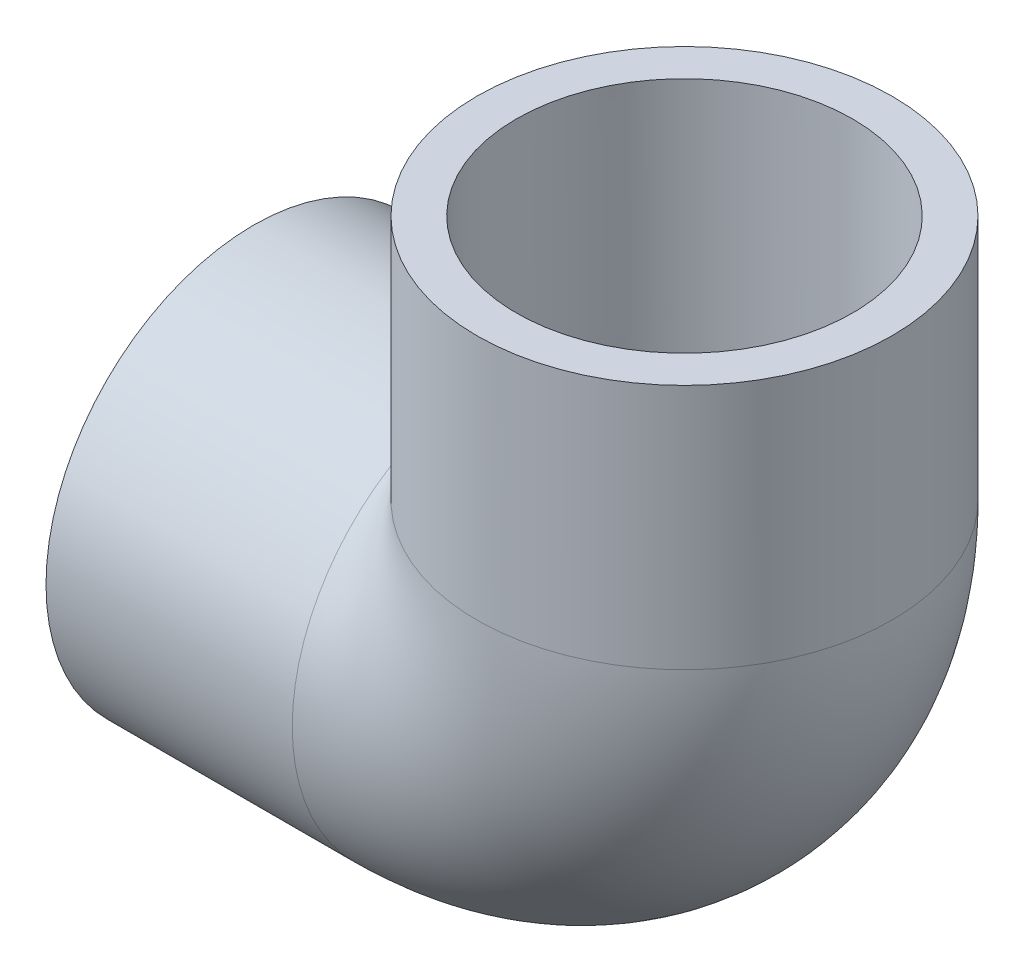
ISO-10303-21;
HEADER;
FILE_DESCRIPTION(('STEP AP214'),'2;1');
FILE_NAME('part.step','',(''),(''),'','','');
FILE_SCHEMA(('AUTOMOTIVE_DESIGN { 1 0 10303 214 1 1 1 1 }'));
ENDSEC;
DATA;
#1=APPLICATION_CONTEXT('core data for automotive mechanical design processes');
#2=APPLICATION_PROTOCOL_DEFINITION('international standard','automotive_design',2000,#1);
#3=PRODUCT_CONTEXT('',#1,'mechanical');
#4=PRODUCT('Part','Part','',(#3));
#5=PRODUCT_RELATED_PRODUCT_CATEGORY('part','',(#4));
#6=PRODUCT_DEFINITION_FORMATION('','',#4);
#7=PRODUCT_DEFINITION_CONTEXT('part definition',#1,'design');
#8=PRODUCT_DEFINITION('design','',#6,#7);
#9=PRODUCT_DEFINITION_SHAPE('','',#8);
#10=(LENGTH_UNIT() NAMED_UNIT(*) SI_UNIT(.MILLI.,.METRE.));
#11=(NAMED_UNIT(*) PLANE_ANGLE_UNIT() SI_UNIT($,.RADIAN.));
#12=(NAMED_UNIT(*) SI_UNIT($,.STERADIAN.) SOLID_ANGLE_UNIT());
#13=UNCERTAINTY_MEASURE_WITH_UNIT(LENGTH_MEASURE(1.E-05),#10,'distance_accuracy_value','');
#14=(GEOMETRIC_REPRESENTATION_CONTEXT(3) GLOBAL_UNCERTAINTY_ASSIGNED_CONTEXT((#13)) GLOBAL_UNIT_ASSIGNED_CONTEXT((#10,
#11,#12)) REPRESENTATION_CONTEXT('',''));
#15=CARTESIAN_POINT('',(0.,0.,0.));
#16=DIRECTION('',(0.,0.,1.));
#17=DIRECTION('',(1.,0.,0.));
#18=AXIS2_PLACEMENT_3D('',#15,#16,#17);
#19=CARTESIAN_POINT('',(-62.23,-29.972,0.));
#20=DIRECTION('',(-1.,0.,0.));
#21=DIRECTION('',(0.,0.,1.));
#22=AXIS2_PLACEMENT_3D('',#19,#20,#21);
#23=PLANE('',#22);
#24=CARTESIAN_POINT('',(-62.23,0.,0.));
#25=DIRECTION('',(-1.,0.,0.));
#26=DIRECTION('',(0.,0.,1.));
#27=AXIS2_PLACEMENT_3D('',#24,#25,#26);
#28=CIRCLE('',#27,29.972);
#29=CARTESIAN_POINT('',(-62.23,0.,29.972));
#30=VERTEX_POINT('',#29);
#31=EDGE_CURVE('E57',#30,#30,#28,.T.);
#32=ORIENTED_EDGE('',*,*,#31,.T.);
#33=EDGE_LOOP('',(#32));
#34=FACE_BOUND('',#33,.T.);
#35=CARTESIAN_POINT('',(-62.23,0.,0.));
#36=DIRECTION('',(-1.,0.,0.));
#37=DIRECTION('',(0.,0.,1.));
#38=AXIS2_PLACEMENT_3D('',#35,#36,#37);
#39=CIRCLE('',#38,24.2824);
#40=CARTESIAN_POINT('',(-62.23,0.,24.2824));
#41=VERTEX_POINT('',#40);
#42=EDGE_CURVE('E44',#41,#41,#39,.T.);
#43=ORIENTED_EDGE('',*,*,#42,.F.);
#44=EDGE_LOOP('',(#43));
#45=FACE_BOUND('',#44,.T.);
#46=ADVANCED_FACE('F37',(#34,#45),#23,.T.);
#47=CARTESIAN_POINT('',(-26.67,0.,0.));
#48=DIRECTION('',(-1.,0.,0.));
#49=DIRECTION('',(0.,0.,1.));
#50=AXIS2_PLACEMENT_3D('',#47,#48,#49);
#51=CONICAL_SURFACE('',#50,24.0538,0.00642848287391597);
#52=ORIENTED_EDGE('',*,*,#42,.T.);
#53=EDGE_LOOP('',(#52));
#54=FACE_BOUND('',#53,.T.);
#55=CARTESIAN_POINT('',(-26.67,0.,0.));
#56=DIRECTION('',(-1.,0.,0.));
#57=DIRECTION('',(0.,0.,1.));
#58=AXIS2_PLACEMENT_3D('',#55,#56,#57);
#59=CIRCLE('',#58,24.0538);
#60=CARTESIAN_POINT('',(-26.67,0.,24.0538));
#61=VERTEX_POINT('',#60);
#62=EDGE_CURVE('E68',#61,#61,#59,.T.);
#63=ORIENTED_EDGE('',*,*,#62,.F.);
#64=EDGE_LOOP('',(#63));
#65=FACE_BOUND('',#64,.T.);
#66=ADVANCED_FACE('F77',(#54,#65),#51,.F.);
#67=CARTESIAN_POINT('',(-62.23,0.,0.));
#68=DIRECTION('',(-1.,0.,0.));
#69=DIRECTION('',(0.,0.,1.));
#70=AXIS2_PLACEMENT_3D('',#67,#68,#69);
#71=CYLINDRICAL_SURFACE('',#70,29.972);
#72=CARTESIAN_POINT('',(0.,0.,0.));
#73=DIRECTION('',(-0.707106781186547,-0.707106781186547,0.));
#74=DIRECTION('',(-0.707106781186547,0.707106781186547,0.));
#75=AXIS2_PLACEMENT_3D('',#72,#73,#74);
#76=ELLIPSE('',#75,42.3868088914464,29.972);
#77=CARTESIAN_POINT('',(-26.67,26.67,-13.6759600759873));
#78=VERTEX_POINT('',#77);
#79=CARTESIAN_POINT('',(-26.67,26.67,13.6759600759873));
#80=VERTEX_POINT('',#79);
#81=EDGE_CURVE('E56',#78,#80,#76,.F.);
#82=ORIENTED_EDGE('',*,*,#81,.F.);
#83=CARTESIAN_POINT('',(-26.67,0.,0.));
#84=DIRECTION('',(-1.,0.,0.));
#85=DIRECTION('',(0.,0.,1.));
#86=AXIS2_PLACEMENT_3D('',#83,#84,#85);
#87=CIRCLE('',#86,29.972);
#88=EDGE_CURVE('E63',#78,#80,#87,.T.);
#89=ORIENTED_EDGE('',*,*,#88,.T.);
#90=EDGE_LOOP('',(#82,#89));
#91=FACE_BOUND('',#90,.T.);
#92=ORIENTED_EDGE('',*,*,#31,.F.);
#93=EDGE_LOOP('',(#92));
#94=FACE_BOUND('',#93,.T.);
#95=ADVANCED_FACE('F61',(#91,#94),#71,.T.);
#96=CARTESIAN_POINT('',(-26.67,26.67,0.));
#97=DIRECTION('',(0.,0.,-1.));
#98=DIRECTION('',(-1.,0.,0.));
#99=AXIS2_PLACEMENT_3D('',#96,#97,#98);
#100=TOROIDAL_SURFACE('',#99,26.67,19.05);
#101=CARTESIAN_POINT('',(0.,26.67,0.));
#102=DIRECTION('',(0.,1.,0.));
#103=DIRECTION('',(0.,0.,-1.));
#104=AXIS2_PLACEMENT_3D('',#101,#102,#103);
#105=CIRCLE('',#104,19.05);
#106=CARTESIAN_POINT('',(19.05,26.67,0.));
#107=VERTEX_POINT('',#106);
#108=EDGE_CURVE('E58',#107,#107,#105,.T.);
#109=CARTESIAN_POINT('',(-26.67,0.,0.));
#110=DIRECTION('',(1.,0.,0.));
#111=DIRECTION('',(0.,0.,-1.));
#112=AXIS2_PLACEMENT_3D('',#109,#110,#111);
#113=CIRCLE('',#112,19.05);
#114=CARTESIAN_POINT('',(-26.67,-19.05,0.));
#115=VERTEX_POINT('',#114);
#116=EDGE_CURVE('E64',#115,#115,#113,.T.);
#117=CARTESIAN_POINT('',(-26.67,26.67,0.));
#118=DIRECTION('',(0.,0.,-1.));
#119=DIRECTION('',(-1.,0.,0.));
#120=AXIS2_PLACEMENT_3D('',#117,#118,#119);
#121=CIRCLE('',#120,45.72);
#122=EDGE_CURVE('',#107,#115,#121,.T.);
#123=ORIENTED_EDGE('',*,*,#108,.T.);
#124=ORIENTED_EDGE('',*,*,#116,.F.);
#125=ORIENTED_EDGE('',*,*,#122,.T.);
#126=ORIENTED_EDGE('',*,*,#122,.F.);
#127=EDGE_LOOP('',(#123,#125,#124,#126));
#128=FACE_BOUND('',#127,.T.);
#129=ADVANCED_FACE('F87',(#128),#100,.F.);
#130=CARTESIAN_POINT('',(-53.34,26.67,0.));
#131=DIRECTION('',(0.,-1.,0.));
#132=DIRECTION('',(-1.,0.,0.));
#133=AXIS2_PLACEMENT_3D('',#130,#131,#132);
#134=CIRCLE('',#133,29.972);
#135=TRIMMED_CURVE('',#134,(PARAMETER_VALUE(-2.66776990694721)),
(PARAMETER_VALUE(2.66776990694721)),.T.,.PARAMETER.);
#136=CARTESIAN_POINT('',(-26.67,26.67,0.));
#137=DIRECTION('',(0.,0.,-1.));
#138=AXIS1_PLACEMENT('',#136,#137);
#139=SURFACE_OF_REVOLUTION('',#135,#138);
#140=CARTESIAN_POINT('',(0.,26.67,0.));
#141=DIRECTION('',(0.,1.,0.));
#142=DIRECTION('',(0.,0.,-1.));
#143=AXIS2_PLACEMENT_3D('',#140,#141,#142);
#144=CIRCLE('',#143,29.972);
#145=EDGE_CURVE('E50',#80,#78,#144,.T.);
#146=ORIENTED_EDGE('',*,*,#145,.F.);
#147=ORIENTED_EDGE('',*,*,#88,.F.);
#148=EDGE_LOOP('',(#146,#147));
#149=FACE_BOUND('',#148,.T.);
#150=ADVANCED_FACE('F67',(#149),#139,.T.);
#151=CARTESIAN_POINT('',(0.,26.67,0.));
#152=DIRECTION('',(0.,1.,0.));
#153=DIRECTION('',(0.,0.,-1.));
#154=AXIS2_PLACEMENT_3D('',#151,#152,#153);
#155=PLANE('',#154);
#156=CARTESIAN_POINT('',(0.,26.67,0.));
#157=DIRECTION('',(0.,1.,0.));
#158=DIRECTION('',(-1.,0.,0.));
#159=AXIS2_PLACEMENT_3D('',#156,#157,#158);
#160=CIRCLE('',#159,24.0538);
#161=CARTESIAN_POINT('',(-24.0538,26.67,0.));
#162=VERTEX_POINT('',#161);
#163=EDGE_CURVE('E11',#162,#162,#160,.F.);
#164=ORIENTED_EDGE('',*,*,#163,.F.);
#165=EDGE_LOOP('',(#164));
#166=FACE_BOUND('',#165,.T.);
#167=ORIENTED_EDGE('',*,*,#108,.F.);
#168=EDGE_LOOP('',(#167));
#169=FACE_BOUND('',#168,.T.);
#170=ADVANCED_FACE('F94',(#166,#169),#155,.T.);
#171=CARTESIAN_POINT('',(-26.67,0.,0.));
#172=DIRECTION('',(1.,0.,0.));
#173=DIRECTION('',(0.,0.,-1.));
#174=AXIS2_PLACEMENT_3D('',#171,#172,#173);
#175=PLANE('',#174);
#176=ORIENTED_EDGE('',*,*,#62,.T.);
#177=EDGE_LOOP('',(#176));
#178=FACE_BOUND('',#177,.T.);
#179=ORIENTED_EDGE('',*,*,#116,.T.);
#180=EDGE_LOOP('',(#179));
#181=FACE_BOUND('',#180,.T.);
#182=ADVANCED_FACE('F97',(#178,#181),#175,.F.);
#183=CARTESIAN_POINT('',(29.972,62.23,0.));
#184=DIRECTION('',(0.,1.,0.));
#185=DIRECTION('',(0.,0.,1.));
#186=AXIS2_PLACEMENT_3D('',#183,#184,#185);
#187=PLANE('',#186);
#188=CARTESIAN_POINT('',(0.,62.23,0.));
#189=DIRECTION('',(0.,-1.,0.));
#190=DIRECTION('',(0.,0.,-1.));
#191=AXIS2_PLACEMENT_3D('',#188,#189,#190);
#192=CIRCLE('',#191,24.2824);
#193=CARTESIAN_POINT('',(0.,62.23,-24.2824));
#194=VERTEX_POINT('',#193);
#195=EDGE_CURVE('E121',#194,#194,#192,.T.);
#196=ORIENTED_EDGE('',*,*,#195,.T.);
#197=EDGE_LOOP('',(#196));
#198=FACE_BOUND('',#197,.T.);
#199=CARTESIAN_POINT('',(0.,62.23,0.));
#200=DIRECTION('',(0.,-1.,0.));
#201=DIRECTION('',(0.,0.,-1.));
#202=AXIS2_PLACEMENT_3D('',#199,#200,#201);
#203=CIRCLE('',#202,29.972);
#204=CARTESIAN_POINT('',(0.,62.23,-29.972));
#205=VERTEX_POINT('',#204);
#206=EDGE_CURVE('E65',#205,#205,#203,.T.);
#207=ORIENTED_EDGE('',*,*,#206,.F.);
#208=EDGE_LOOP('',(#207));
#209=FACE_BOUND('',#208,.T.);
#210=ADVANCED_FACE('F104',(#198,#209),#187,.T.);
#211=CARTESIAN_POINT('',(0.,0.,0.));
#212=DIRECTION('',(0.,-1.,0.));
#213=DIRECTION('',(0.,0.,-1.));
#214=AXIS2_PLACEMENT_3D('',#211,#212,#213);
#215=CYLINDRICAL_SURFACE('',#214,29.972);
#216=ORIENTED_EDGE('',*,*,#206,.T.);
#217=EDGE_LOOP('',(#216));
#218=FACE_BOUND('',#217,.T.);
#219=ORIENTED_EDGE('',*,*,#145,.T.);
#220=ORIENTED_EDGE('',*,*,#81,.T.);
#221=EDGE_LOOP('',(#219,#220));
#222=FACE_BOUND('',#221,.T.);
#223=ADVANCED_FACE('F55',(#218,#222),#215,.T.);
#224=CARTESIAN_POINT('',(0.,62.23,0.));
#225=DIRECTION('',(0.,1.,0.));
#226=DIRECTION('',(0.,0.,1.));
#227=AXIS2_PLACEMENT_3D('',#224,#225,#226);
#228=CONICAL_SURFACE('',#227,24.2824,0.00642848287391597);
#229=ORIENTED_EDGE('',*,*,#163,.T.);
#230=EDGE_LOOP('',(#229));
#231=FACE_BOUND('',#230,.T.);
#232=ORIENTED_EDGE('',*,*,#195,.F.);
#233=EDGE_LOOP('',(#232));
#234=FACE_BOUND('',#233,.T.);
#235=ADVANCED_FACE('F111',(#231,#234),#228,.F.);
#236=CLOSED_SHELL('',(#46,#66,#95,#129,#150,#170,#182,#210,#223,#235));
#237=MANIFOLD_SOLID_BREP('B2',#236);
#238=ADVANCED_BREP_SHAPE_REPRESENTATION('',(#18,#237),#14);
#239=SHAPE_DEFINITION_REPRESENTATION(#9,#238);
ENDSEC;
END-ISO-10303-21;
